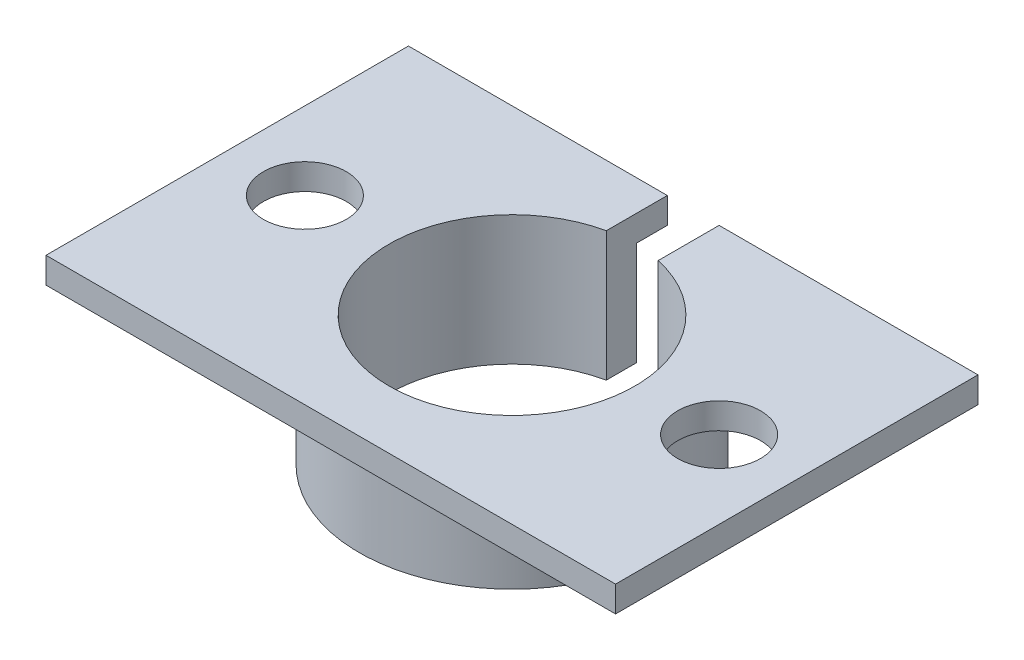
ISO-10303-21;
HEADER;
FILE_DESCRIPTION(('STEP AP214'),'2;1');
FILE_NAME('part.step','',(''),(''),'','','');
FILE_SCHEMA(('AUTOMOTIVE_DESIGN { 1 0 10303 214 1 1 1 1 }'));
ENDSEC;
DATA;
#1=APPLICATION_CONTEXT('core data for automotive mechanical design processes');
#2=APPLICATION_PROTOCOL_DEFINITION('international standard','automotive_design',2000,#1);
#3=PRODUCT_CONTEXT('',#1,'mechanical');
#4=PRODUCT('Part','Part','',(#3));
#5=PRODUCT_RELATED_PRODUCT_CATEGORY('part','',(#4));
#6=PRODUCT_DEFINITION_FORMATION('','',#4);
#7=PRODUCT_DEFINITION_CONTEXT('part definition',#1,'design');
#8=PRODUCT_DEFINITION('design','',#6,#7);
#9=PRODUCT_DEFINITION_SHAPE('','',#8);
#10=(LENGTH_UNIT() NAMED_UNIT(*) SI_UNIT(.MILLI.,.METRE.));
#11=(NAMED_UNIT(*) PLANE_ANGLE_UNIT() SI_UNIT($,.RADIAN.));
#12=(NAMED_UNIT(*) SI_UNIT($,.STERADIAN.) SOLID_ANGLE_UNIT());
#13=UNCERTAINTY_MEASURE_WITH_UNIT(LENGTH_MEASURE(1.E-05),#10,'distance_accuracy_value','');
#14=(GEOMETRIC_REPRESENTATION_CONTEXT(3) GLOBAL_UNCERTAINTY_ASSIGNED_CONTEXT((#13)) GLOBAL_UNIT_ASSIGNED_CONTEXT((#10,
#11,#12)) REPRESENTATION_CONTEXT('',''));
#15=CARTESIAN_POINT('',(0.,0.,0.));
#16=DIRECTION('',(0.,0.,1.));
#17=DIRECTION('',(1.,0.,0.));
#18=AXIS2_PLACEMENT_3D('',#15,#16,#17);
#19=CARTESIAN_POINT('',(-11.,1.,-7.));
#20=DIRECTION('',(0.,0.,1.));
#21=DIRECTION('',(1.,0.,0.));
#22=AXIS2_PLACEMENT_3D('',#19,#20,#21);
#23=PLANE('',#22);
#24=DIRECTION('',(-1.,0.,0.));
#25=VECTOR('',#24,1.);
#26=CARTESIAN_POINT('',(-11.,0.,-7.));
#27=LINE('',#26,#25);
#28=CARTESIAN_POINT('',(11.,0.,-7.));
#29=VERTEX_POINT('',#28);
#30=CARTESIAN_POINT('',(1.,0.,-7.));
#31=VERTEX_POINT('',#30);
#32=EDGE_CURVE('E152',#29,#31,#27,.T.);
#33=ORIENTED_EDGE('',*,*,#32,.T.);
#34=DIRECTION('',(0.,1.,0.));
#35=VECTOR('',#34,1.);
#36=CARTESIAN_POINT('',(1.,1.,-7.));
#37=LINE('',#36,#35);
#38=CARTESIAN_POINT('',(1.,1.,-7.));
#39=VERTEX_POINT('',#38);
#40=EDGE_CURVE('E199',#31,#39,#37,.T.);
#41=ORIENTED_EDGE('',*,*,#40,.T.);
#42=DIRECTION('',(-1.,0.,0.));
#43=VECTOR('',#42,1.);
#44=CARTESIAN_POINT('',(-11.,1.,-7.));
#45=LINE('',#44,#43);
#46=CARTESIAN_POINT('',(11.,1.,-7.));
#47=VERTEX_POINT('',#46);
#48=EDGE_CURVE('E136',#47,#39,#45,.T.);
#49=ORIENTED_EDGE('',*,*,#48,.F.);
#50=DIRECTION('',(0.,-1.,0.));
#51=VECTOR('',#50,1.);
#52=CARTESIAN_POINT('',(11.,1.,-7.));
#53=LINE('',#52,#51);
#54=EDGE_CURVE('E157',#47,#29,#53,.T.);
#55=ORIENTED_EDGE('',*,*,#54,.T.);
#56=EDGE_LOOP('',(#33,#41,#49,#55));
#57=FACE_BOUND('',#56,.T.);
#58=ADVANCED_FACE('F34',(#57),#23,.F.);
#59=CARTESIAN_POINT('',(0.,0.,0.));
#60=DIRECTION('',(0.,1.,0.));
#61=DIRECTION('',(0.,0.,1.));
#62=AXIS2_PLACEMENT_3D('',#59,#60,#61);
#63=PLANE('',#62);
#64=CARTESIAN_POINT('',(8.,0.,0.));
#65=DIRECTION('',(0.,1.,0.));
#66=DIRECTION('',(0.,0.,1.));
#67=AXIS2_PLACEMENT_3D('',#64,#65,#66);
#68=CIRCLE('',#67,1.6);
#69=CARTESIAN_POINT('',(8.,0.,1.6));
#70=VERTEX_POINT('',#69);
#71=EDGE_CURVE('E182',#70,#70,#68,.T.);
#72=ORIENTED_EDGE('',*,*,#71,.T.);
#73=EDGE_LOOP('',(#72));
#74=FACE_BOUND('',#73,.T.);
#75=CARTESIAN_POINT('',(-8.,0.,0.));
#76=DIRECTION('',(0.,1.,0.));
#77=DIRECTION('',(0.,0.,1.));
#78=AXIS2_PLACEMENT_3D('',#75,#76,#77);
#79=CIRCLE('',#78,1.6);
#80=CARTESIAN_POINT('',(-8.,0.,1.6));
#81=VERTEX_POINT('',#80);
#82=EDGE_CURVE('E220',#81,#81,#79,.T.);
#83=ORIENTED_EDGE('',*,*,#82,.T.);
#84=EDGE_LOOP('',(#83));
#85=FACE_BOUND('',#84,.T.);
#86=CARTESIAN_POINT('',(0.,0.,0.));
#87=DIRECTION('',(0.,1.,0.));
#88=DIRECTION('',(0.,0.,1.));
#89=AXIS2_PLACEMENT_3D('',#86,#87,#88);
#90=CIRCLE('',#89,5.9);
#91=CARTESIAN_POINT('',(1.,0.,-5.81463670404265));
#92=VERTEX_POINT('',#91);
#93=CARTESIAN_POINT('',(-1.,0.,-5.81463670404265));
#94=VERTEX_POINT('',#93);
#95=EDGE_CURVE('E166',#92,#94,#90,.F.);
#96=ORIENTED_EDGE('',*,*,#95,.F.);
#97=DIRECTION('',(0.,0.,-1.));
#98=VECTOR('',#97,1.);
#99=CARTESIAN_POINT('',(1.,0.,0.));
#100=LINE('',#99,#98);
#101=EDGE_CURVE('E49',#92,#31,#100,.T.);
#102=ORIENTED_EDGE('',*,*,#101,.T.);
#103=ORIENTED_EDGE('',*,*,#32,.F.);
#104=DIRECTION('',(0.,0.,-1.));
#105=VECTOR('',#104,1.);
#106=CARTESIAN_POINT('',(11.,0.,-7.));
#107=LINE('',#106,#105);
#108=CARTESIAN_POINT('',(11.,0.,7.));
#109=VERTEX_POINT('',#108);
#110=EDGE_CURVE('E149',#109,#29,#107,.T.);
#111=ORIENTED_EDGE('',*,*,#110,.F.);
#112=DIRECTION('',(1.,0.,0.));
#113=VECTOR('',#112,1.);
#114=CARTESIAN_POINT('',(-11.,0.,7.));
#115=LINE('',#114,#113);
#116=CARTESIAN_POINT('',(-11.,0.,7.));
#117=VERTEX_POINT('',#116);
#118=EDGE_CURVE('E147',#117,#109,#115,.T.);
#119=ORIENTED_EDGE('',*,*,#118,.F.);
#120=DIRECTION('',(0.,0.,1.));
#121=VECTOR('',#120,1.);
#122=CARTESIAN_POINT('',(-11.,0.,-7.));
#123=LINE('',#122,#121);
#124=CARTESIAN_POINT('',(-11.,0.,-7.));
#125=VERTEX_POINT('',#124);
#126=EDGE_CURVE('E144',#125,#117,#123,.T.);
#127=ORIENTED_EDGE('',*,*,#126,.F.);
#128=CARTESIAN_POINT('',(-1.,0.,-7.));
#129=VERTEX_POINT('',#128);
#130=EDGE_CURVE('E151',#129,#125,#27,.T.);
#131=ORIENTED_EDGE('',*,*,#130,.F.);
#132=DIRECTION('',(0.,0.,1.));
#133=VECTOR('',#132,1.);
#134=CARTESIAN_POINT('',(-1.,0.,0.));
#135=LINE('',#134,#133);
#136=EDGE_CURVE('E114',#129,#94,#135,.T.);
#137=ORIENTED_EDGE('',*,*,#136,.T.);
#138=EDGE_LOOP('',(#96,#102,#103,#111,#119,#127,#131,#137));
#139=FACE_BOUND('',#138,.T.);
#140=ADVANCED_FACE('F237',(#74,#85,#139),#63,.F.);
#141=CARTESIAN_POINT('',(-11.,1.,-7.));
#142=DIRECTION('',(1.,0.,0.));
#143=DIRECTION('',(0.,0.,-1.));
#144=AXIS2_PLACEMENT_3D('',#141,#142,#143);
#145=PLANE('',#144);
#146=ORIENTED_EDGE('',*,*,#126,.T.);
#147=DIRECTION('',(0.,-1.,0.));
#148=VECTOR('',#147,1.);
#149=CARTESIAN_POINT('',(-11.,1.,7.));
#150=LINE('',#149,#148);
#151=CARTESIAN_POINT('',(-11.,1.,7.));
#152=VERTEX_POINT('',#151);
#153=EDGE_CURVE('E163',#152,#117,#150,.T.);
#154=ORIENTED_EDGE('',*,*,#153,.F.);
#155=DIRECTION('',(0.,0.,1.));
#156=VECTOR('',#155,1.);
#157=CARTESIAN_POINT('',(-11.,1.,-7.));
#158=LINE('',#157,#156);
#159=CARTESIAN_POINT('',(-11.,1.,-7.));
#160=VERTEX_POINT('',#159);
#161=EDGE_CURVE('E155',#160,#152,#158,.T.);
#162=ORIENTED_EDGE('',*,*,#161,.F.);
#163=DIRECTION('',(0.,-1.,0.));
#164=VECTOR('',#163,1.);
#165=CARTESIAN_POINT('',(-11.,1.,-7.));
#166=LINE('',#165,#164);
#167=EDGE_CURVE('E134',#160,#125,#166,.T.);
#168=ORIENTED_EDGE('',*,*,#167,.T.);
#169=EDGE_LOOP('',(#146,#154,#162,#168));
#170=FACE_BOUND('',#169,.T.);
#171=ADVANCED_FACE('F36',(#170),#145,.F.);
#172=CARTESIAN_POINT('',(-11.,1.,7.));
#173=DIRECTION('',(0.,0.,-1.));
#174=DIRECTION('',(-1.,0.,0.));
#175=AXIS2_PLACEMENT_3D('',#172,#173,#174);
#176=PLANE('',#175);
#177=ORIENTED_EDGE('',*,*,#118,.T.);
#178=DIRECTION('',(0.,-1.,0.));
#179=VECTOR('',#178,1.);
#180=CARTESIAN_POINT('',(11.,1.,7.));
#181=LINE('',#180,#179);
#182=CARTESIAN_POINT('',(11.,1.,7.));
#183=VERTEX_POINT('',#182);
#184=EDGE_CURVE('E160',#183,#109,#181,.T.);
#185=ORIENTED_EDGE('',*,*,#184,.F.);
#186=DIRECTION('',(1.,0.,0.));
#187=VECTOR('',#186,1.);
#188=CARTESIAN_POINT('',(-11.,1.,7.));
#189=LINE('',#188,#187);
#190=EDGE_CURVE('E140',#152,#183,#189,.T.);
#191=ORIENTED_EDGE('',*,*,#190,.F.);
#192=ORIENTED_EDGE('',*,*,#153,.T.);
#193=EDGE_LOOP('',(#177,#185,#191,#192));
#194=FACE_BOUND('',#193,.T.);
#195=ADVANCED_FACE('F191',(#194),#176,.F.);
#196=CARTESIAN_POINT('',(11.,1.,-7.));
#197=DIRECTION('',(-1.,0.,0.));
#198=DIRECTION('',(0.,0.,1.));
#199=AXIS2_PLACEMENT_3D('',#196,#197,#198);
#200=PLANE('',#199);
#201=ORIENTED_EDGE('',*,*,#110,.T.);
#202=ORIENTED_EDGE('',*,*,#54,.F.);
#203=DIRECTION('',(0.,0.,-1.));
#204=VECTOR('',#203,1.);
#205=CARTESIAN_POINT('',(11.,1.,-7.));
#206=LINE('',#205,#204);
#207=EDGE_CURVE('E137',#183,#47,#206,.T.);
#208=ORIENTED_EDGE('',*,*,#207,.F.);
#209=ORIENTED_EDGE('',*,*,#184,.T.);
#210=EDGE_LOOP('',(#201,#202,#208,#209));
#211=FACE_BOUND('',#210,.T.);
#212=ADVANCED_FACE('F194',(#211),#200,.F.);
#213=CARTESIAN_POINT('',(-1.,1.,-7.));
#214=VERTEX_POINT('',#213);
#215=EDGE_CURVE('E126',#214,#160,#45,.T.);
#216=ORIENTED_EDGE('',*,*,#215,.F.);
#217=DIRECTION('',(0.,-1.,0.));
#218=VECTOR('',#217,1.);
#219=CARTESIAN_POINT('',(-1.,1.,-7.));
#220=LINE('',#219,#218);
#221=EDGE_CURVE('E108',#214,#129,#220,.T.);
#222=ORIENTED_EDGE('',*,*,#221,.T.);
#223=ORIENTED_EDGE('',*,*,#130,.T.);
#224=ORIENTED_EDGE('',*,*,#167,.F.);
#225=EDGE_LOOP('',(#216,#222,#223,#224));
#226=FACE_BOUND('',#225,.T.);
#227=ADVANCED_FACE('F132',(#226),#23,.F.);
#228=CARTESIAN_POINT('',(0.,1.,0.));
#229=DIRECTION('',(0.,1.,0.));
#230=DIRECTION('',(0.,0.,1.));
#231=AXIS2_PLACEMENT_3D('',#228,#229,#230);
#232=PLANE('',#231);
#233=DIRECTION('',(0.,0.,-1.));
#234=VECTOR('',#233,1.);
#235=CARTESIAN_POINT('',(1.,1.,-0.00844093741744393));
#236=LINE('',#235,#234);
#237=CARTESIAN_POINT('',(1.,1.,-4.64354390525168));
#238=VERTEX_POINT('',#237);
#239=EDGE_CURVE('E130',#238,#39,#236,.T.);
#240=ORIENTED_EDGE('',*,*,#239,.F.);
#241=CARTESIAN_POINT('',(0.,1.,0.));
#242=DIRECTION('',(0.,1.,0.));
#243=DIRECTION('',(0.,0.,1.));
#244=AXIS2_PLACEMENT_3D('',#241,#242,#243);
#245=CIRCLE('',#244,4.75);
#246=CARTESIAN_POINT('',(-1.,1.,-4.64354390525168));
#247=VERTEX_POINT('',#246);
#248=EDGE_CURVE('E129',#247,#238,#245,.T.);
#249=ORIENTED_EDGE('',*,*,#248,.F.);
#250=DIRECTION('',(0.,0.,1.));
#251=VECTOR('',#250,1.);
#252=CARTESIAN_POINT('',(-1.,1.,-0.00844093741744393));
#253=LINE('',#252,#251);
#254=EDGE_CURVE('E111',#214,#247,#253,.T.);
#255=ORIENTED_EDGE('',*,*,#254,.F.);
#256=ORIENTED_EDGE('',*,*,#215,.T.);
#257=ORIENTED_EDGE('',*,*,#161,.T.);
#258=ORIENTED_EDGE('',*,*,#190,.T.);
#259=ORIENTED_EDGE('',*,*,#207,.T.);
#260=ORIENTED_EDGE('',*,*,#48,.T.);
#261=EDGE_LOOP('',(#240,#249,#255,#256,#257,#258,#259,#260));
#262=FACE_BOUND('',#261,.T.);
#263=CARTESIAN_POINT('',(8.,1.,0.));
#264=DIRECTION('',(0.,1.,0.));
#265=DIRECTION('',(0.,0.,1.));
#266=AXIS2_PLACEMENT_3D('',#263,#264,#265);
#267=CIRCLE('',#266,1.6);
#268=CARTESIAN_POINT('',(8.,1.,1.6));
#269=VERTEX_POINT('',#268);
#270=EDGE_CURVE('E217',#269,#269,#267,.T.);
#271=ORIENTED_EDGE('',*,*,#270,.F.);
#272=EDGE_LOOP('',(#271));
#273=FACE_BOUND('',#272,.T.);
#274=CARTESIAN_POINT('',(-8.,1.,0.));
#275=DIRECTION('',(0.,1.,0.));
#276=DIRECTION('',(0.,0.,1.));
#277=AXIS2_PLACEMENT_3D('',#274,#275,#276);
#278=CIRCLE('',#277,1.6);
#279=CARTESIAN_POINT('',(-8.,1.,1.6));
#280=VERTEX_POINT('',#279);
#281=EDGE_CURVE('E214',#280,#280,#278,.T.);
#282=ORIENTED_EDGE('',*,*,#281,.F.);
#283=EDGE_LOOP('',(#282));
#284=FACE_BOUND('',#283,.T.);
#285=ADVANCED_FACE('F123',(#262,#273,#284),#232,.T.);
#286=CARTESIAN_POINT('',(0.,0.,0.));
#287=DIRECTION('',(0.,1.,0.));
#288=DIRECTION('',(0.,0.,1.));
#289=AXIS2_PLACEMENT_3D('',#286,#287,#288);
#290=CYLINDRICAL_SURFACE('',#289,4.75);
#291=ORIENTED_EDGE('',*,*,#248,.T.);
#292=DIRECTION('',(0.,1.,0.));
#293=VECTOR('',#292,1.);
#294=CARTESIAN_POINT('',(1.,0.,-4.64354390525168));
#295=LINE('',#294,#293);
#296=CARTESIAN_POINT('',(1.,-4.,-4.64354390525168));
#297=VERTEX_POINT('',#296);
#298=EDGE_CURVE('E204',#238,#297,#295,.F.);
#299=ORIENTED_EDGE('',*,*,#298,.T.);
#300=CARTESIAN_POINT('',(0.,-4.,0.));
#301=DIRECTION('',(0.,-1.,0.));
#302=DIRECTION('',(0.,0.,-1.));
#303=AXIS2_PLACEMENT_3D('',#300,#301,#302);
#304=CIRCLE('',#303,4.75);
#305=CARTESIAN_POINT('',(-1.,-4.,-4.64354390525168));
#306=VERTEX_POINT('',#305);
#307=EDGE_CURVE('E179',#297,#306,#304,.T.);
#308=ORIENTED_EDGE('',*,*,#307,.T.);
#309=DIRECTION('',(0.,1.,0.));
#310=VECTOR('',#309,1.);
#311=CARTESIAN_POINT('',(-1.,0.,-4.64354390525168));
#312=LINE('',#311,#310);
#313=EDGE_CURVE('E205',#306,#247,#312,.T.);
#314=ORIENTED_EDGE('',*,*,#313,.T.);
#315=EDGE_LOOP('',(#291,#299,#308,#314));
#316=FACE_BOUND('',#315,.T.);
#317=ADVANCED_FACE('F203',(#316),#290,.F.);
#318=CARTESIAN_POINT('',(0.,-4.,0.));
#319=DIRECTION('',(0.,-1.,0.));
#320=DIRECTION('',(0.,0.,-1.));
#321=AXIS2_PLACEMENT_3D('',#318,#319,#320);
#322=PLANE('',#321);
#323=DIRECTION('',(0.,0.,1.));
#324=VECTOR('',#323,1.);
#325=CARTESIAN_POINT('',(1.,-4.,0.));
#326=LINE('',#325,#324);
#327=CARTESIAN_POINT('',(1.,-4.,-5.81463670404265));
#328=VERTEX_POINT('',#327);
#329=EDGE_CURVE('E118',#328,#297,#326,.T.);
#330=ORIENTED_EDGE('',*,*,#329,.F.);
#331=CARTESIAN_POINT('',(0.,-4.,0.));
#332=DIRECTION('',(0.,-1.,0.));
#333=DIRECTION('',(0.,0.,-1.));
#334=AXIS2_PLACEMENT_3D('',#331,#332,#333);
#335=CIRCLE('',#334,5.9);
#336=CARTESIAN_POINT('',(-1.,-4.,-5.81463670404265));
#337=VERTEX_POINT('',#336);
#338=EDGE_CURVE('E172',#328,#337,#335,.T.);
#339=ORIENTED_EDGE('',*,*,#338,.T.);
#340=DIRECTION('',(0.,0.,-1.));
#341=VECTOR('',#340,1.);
#342=CARTESIAN_POINT('',(-1.,-4.,0.));
#343=LINE('',#342,#341);
#344=EDGE_CURVE('E56',#306,#337,#343,.T.);
#345=ORIENTED_EDGE('',*,*,#344,.F.);
#346=ORIENTED_EDGE('',*,*,#307,.F.);
#347=EDGE_LOOP('',(#330,#339,#345,#346));
#348=FACE_BOUND('',#347,.T.);
#349=ADVANCED_FACE('F176',(#348),#322,.T.);
#350=CARTESIAN_POINT('',(0.,-4.,0.));
#351=DIRECTION('',(0.,1.,0.));
#352=DIRECTION('',(0.,0.,1.));
#353=AXIS2_PLACEMENT_3D('',#350,#351,#352);
#354=CYLINDRICAL_SURFACE('',#353,5.9);
#355=ORIENTED_EDGE('',*,*,#338,.F.);
#356=DIRECTION('',(0.,1.,0.));
#357=VECTOR('',#356,1.);
#358=CARTESIAN_POINT('',(1.,-4.,-5.81463670404265));
#359=LINE('',#358,#357);
#360=EDGE_CURVE('E11',#328,#92,#359,.T.);
#361=ORIENTED_EDGE('',*,*,#360,.T.);
#362=ORIENTED_EDGE('',*,*,#95,.T.);
#363=DIRECTION('',(0.,1.,0.));
#364=VECTOR('',#363,1.);
#365=CARTESIAN_POINT('',(-1.,-4.,-5.81463670404265));
#366=LINE('',#365,#364);
#367=EDGE_CURVE('E42',#94,#337,#366,.F.);
#368=ORIENTED_EDGE('',*,*,#367,.T.);
#369=EDGE_LOOP('',(#355,#361,#362,#368));
#370=FACE_BOUND('',#369,.T.);
#371=ADVANCED_FACE('F171',(#370),#354,.T.);
#372=CARTESIAN_POINT('',(-8.,0.,0.));
#373=DIRECTION('',(0.,1.,0.));
#374=DIRECTION('',(0.,0.,1.));
#375=AXIS2_PLACEMENT_3D('',#372,#373,#374);
#376=CYLINDRICAL_SURFACE('',#375,1.6);
#377=ORIENTED_EDGE('',*,*,#82,.F.);
#378=EDGE_LOOP('',(#377));
#379=FACE_BOUND('',#378,.T.);
#380=ORIENTED_EDGE('',*,*,#281,.T.);
#381=EDGE_LOOP('',(#380));
#382=FACE_BOUND('',#381,.T.);
#383=ADVANCED_FACE('F225',(#379,#382),#376,.F.);
#384=CARTESIAN_POINT('',(8.,0.,0.));
#385=DIRECTION('',(0.,1.,0.));
#386=DIRECTION('',(0.,0.,1.));
#387=AXIS2_PLACEMENT_3D('',#384,#385,#386);
#388=CYLINDRICAL_SURFACE('',#387,1.6);
#389=ORIENTED_EDGE('',*,*,#71,.F.);
#390=EDGE_LOOP('',(#389));
#391=FACE_BOUND('',#390,.T.);
#392=ORIENTED_EDGE('',*,*,#270,.T.);
#393=EDGE_LOOP('',(#392));
#394=FACE_BOUND('',#393,.T.);
#395=ADVANCED_FACE('F306',(#391,#394),#388,.F.);
#396=CARTESIAN_POINT('',(-1.,-9.,-0.00844093741744393));
#397=DIRECTION('',(-1.,0.,0.));
#398=DIRECTION('',(0.,0.,1.));
#399=AXIS2_PLACEMENT_3D('',#396,#397,#398);
#400=PLANE('',#399);
#401=ORIENTED_EDGE('',*,*,#254,.T.);
#402=ORIENTED_EDGE('',*,*,#313,.F.);
#403=ORIENTED_EDGE('',*,*,#344,.T.);
#404=ORIENTED_EDGE('',*,*,#367,.F.);
#405=ORIENTED_EDGE('',*,*,#136,.F.);
#406=ORIENTED_EDGE('',*,*,#221,.F.);
#407=EDGE_LOOP('',(#401,#402,#403,#404,#405,#406));
#408=FACE_BOUND('',#407,.T.);
#409=ADVANCED_FACE('F110',(#408),#400,.F.);
#410=CARTESIAN_POINT('',(1.,-9.,-0.00844093741744393));
#411=DIRECTION('',(1.,0.,0.));
#412=DIRECTION('',(0.,0.,-1.));
#413=AXIS2_PLACEMENT_3D('',#410,#411,#412);
#414=PLANE('',#413);
#415=ORIENTED_EDGE('',*,*,#101,.F.);
#416=ORIENTED_EDGE('',*,*,#360,.F.);
#417=ORIENTED_EDGE('',*,*,#329,.T.);
#418=ORIENTED_EDGE('',*,*,#298,.F.);
#419=ORIENTED_EDGE('',*,*,#239,.T.);
#420=ORIENTED_EDGE('',*,*,#40,.F.);
#421=EDGE_LOOP('',(#415,#416,#417,#418,#419,#420));
#422=FACE_BOUND('',#421,.T.);
#423=ADVANCED_FACE('F305',(#422),#414,.F.);
#424=CLOSED_SHELL('',(#58,#140,#171,#195,#212,#227,#285,#317,#349,#371,#383,#395,#409,#423));
#425=MANIFOLD_SOLID_BREP('B2',#424);
#426=ADVANCED_BREP_SHAPE_REPRESENTATION('',(#18,#425),#14);
#427=SHAPE_DEFINITION_REPRESENTATION(#9,#426);
ENDSEC;
END-ISO-10303-21;
